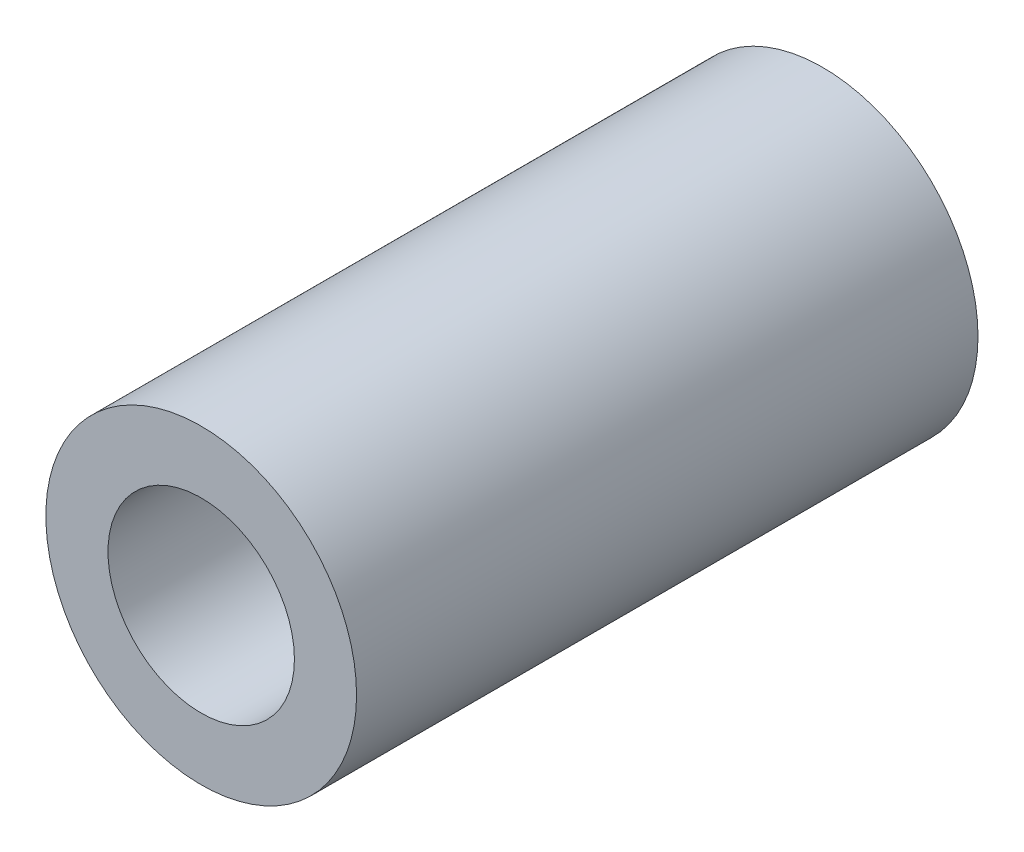
ISO-10303-21;
HEADER;
FILE_DESCRIPTION(('STEP AP214'),'2;1');
FILE_NAME('part.step','',(''),(''),'','','');
FILE_SCHEMA(('AUTOMOTIVE_DESIGN { 1 0 10303 214 1 1 1 1 }'));
ENDSEC;
DATA;
#1=APPLICATION_CONTEXT('core data for automotive mechanical design processes');
#2=APPLICATION_PROTOCOL_DEFINITION('international standard','automotive_design',2000,#1);
#3=PRODUCT_CONTEXT('',#1,'mechanical');
#4=PRODUCT('Part','Part','',(#3));
#5=PRODUCT_RELATED_PRODUCT_CATEGORY('part','',(#4));
#6=PRODUCT_DEFINITION_FORMATION('','',#4);
#7=PRODUCT_DEFINITION_CONTEXT('part definition',#1,'design');
#8=PRODUCT_DEFINITION('design','',#6,#7);
#9=PRODUCT_DEFINITION_SHAPE('','',#8);
#10=(LENGTH_UNIT() NAMED_UNIT(*) SI_UNIT(.MILLI.,.METRE.));
#11=(NAMED_UNIT(*) PLANE_ANGLE_UNIT() SI_UNIT($,.RADIAN.));
#12=(NAMED_UNIT(*) SI_UNIT($,.STERADIAN.) SOLID_ANGLE_UNIT());
#13=UNCERTAINTY_MEASURE_WITH_UNIT(LENGTH_MEASURE(1.E-05),#10,'distance_accuracy_value','');
#14=(GEOMETRIC_REPRESENTATION_CONTEXT(3) GLOBAL_UNCERTAINTY_ASSIGNED_CONTEXT((#13)) GLOBAL_UNIT_ASSIGNED_CONTEXT((#10,
#11,#12)) REPRESENTATION_CONTEXT('',''));
#15=CARTESIAN_POINT('',(0.,0.,0.));
#16=DIRECTION('',(0.,0.,1.));
#17=DIRECTION('',(1.,0.,0.));
#18=AXIS2_PLACEMENT_3D('',#15,#16,#17);
#19=CARTESIAN_POINT('',(0.,0.,20.));
#20=DIRECTION('',(0.,0.,1.));
#21=DIRECTION('',(1.,0.,0.));
#22=AXIS2_PLACEMENT_3D('',#19,#20,#21);
#23=PLANE('',#22);
#24=CARTESIAN_POINT('',(0.,0.,20.));
#25=DIRECTION('',(0.,0.,1.));
#26=DIRECTION('',(1.,0.,0.));
#27=AXIS2_PLACEMENT_3D('',#24,#25,#26);
#28=CIRCLE('',#27,5.);
#29=CARTESIAN_POINT('',(5.,0.,20.));
#30=VERTEX_POINT('',#29);
#31=EDGE_CURVE('E10',#30,#30,#28,.T.);
#32=ORIENTED_EDGE('',*,*,#31,.T.);
#33=EDGE_LOOP('',(#32));
#34=FACE_BOUND('',#33,.T.);
#35=CARTESIAN_POINT('',(0.,0.,20.));
#36=DIRECTION('',(0.,0.,1.));
#37=DIRECTION('',(1.,0.,0.));
#38=AXIS2_PLACEMENT_3D('',#35,#36,#37);
#39=CIRCLE('',#38,3.);
#40=CARTESIAN_POINT('',(3.,0.,20.));
#41=VERTEX_POINT('',#40);
#42=EDGE_CURVE('E50',#41,#41,#39,.T.);
#43=ORIENTED_EDGE('',*,*,#42,.F.);
#44=EDGE_LOOP('',(#43));
#45=FACE_BOUND('',#44,.T.);
#46=ADVANCED_FACE('F37',(#34,#45),#23,.T.);
#47=CARTESIAN_POINT('',(0.,0.,0.));
#48=DIRECTION('',(0.,0.,1.));
#49=DIRECTION('',(1.,0.,0.));
#50=AXIS2_PLACEMENT_3D('',#47,#48,#49);
#51=PLANE('',#50);
#52=CARTESIAN_POINT('',(0.,0.,0.));
#53=DIRECTION('',(0.,0.,1.));
#54=DIRECTION('',(1.,0.,0.));
#55=AXIS2_PLACEMENT_3D('',#52,#53,#54);
#56=CIRCLE('',#55,5.);
#57=CARTESIAN_POINT('',(5.,0.,0.));
#58=VERTEX_POINT('',#57);
#59=EDGE_CURVE('E41',#58,#58,#56,.T.);
#60=ORIENTED_EDGE('',*,*,#59,.F.);
#61=EDGE_LOOP('',(#60));
#62=FACE_BOUND('',#61,.T.);
#63=CARTESIAN_POINT('',(0.,0.,0.));
#64=DIRECTION('',(0.,0.,1.));
#65=DIRECTION('',(1.,0.,0.));
#66=AXIS2_PLACEMENT_3D('',#63,#64,#65);
#67=CIRCLE('',#66,3.);
#68=CARTESIAN_POINT('',(3.,0.,0.));
#69=VERTEX_POINT('',#68);
#70=EDGE_CURVE('E52',#69,#69,#67,.T.);
#71=ORIENTED_EDGE('',*,*,#70,.T.);
#72=EDGE_LOOP('',(#71));
#73=FACE_BOUND('',#72,.T.);
#74=ADVANCED_FACE('F64',(#62,#73),#51,.F.);
#75=CARTESIAN_POINT('',(0.,0.,20.));
#76=DIRECTION('',(0.,0.,-1.));
#77=DIRECTION('',(-1.,0.,0.));
#78=AXIS2_PLACEMENT_3D('',#75,#76,#77);
#79=CYLINDRICAL_SURFACE('',#78,5.);
#80=ORIENTED_EDGE('',*,*,#31,.F.);
#81=EDGE_LOOP('',(#80));
#82=FACE_BOUND('',#81,.T.);
#83=ORIENTED_EDGE('',*,*,#59,.T.);
#84=EDGE_LOOP('',(#83));
#85=FACE_BOUND('',#84,.T.);
#86=ADVANCED_FACE('F39',(#82,#85),#79,.T.);
#87=CARTESIAN_POINT('',(0.,0.,20.));
#88=DIRECTION('',(0.,0.,-1.));
#89=DIRECTION('',(-1.,0.,0.));
#90=AXIS2_PLACEMENT_3D('',#87,#88,#89);
#91=CYLINDRICAL_SURFACE('',#90,3.);
#92=ORIENTED_EDGE('',*,*,#42,.T.);
#93=EDGE_LOOP('',(#92));
#94=FACE_BOUND('',#93,.T.);
#95=ORIENTED_EDGE('',*,*,#70,.F.);
#96=EDGE_LOOP('',(#95));
#97=FACE_BOUND('',#96,.T.);
#98=ADVANCED_FACE('F60',(#94,#97),#91,.F.);
#99=CLOSED_SHELL('',(#46,#74,#86,#98));
#100=MANIFOLD_SOLID_BREP('B2',#99);
#101=ADVANCED_BREP_SHAPE_REPRESENTATION('',(#18,#100),#14);
#102=SHAPE_DEFINITION_REPRESENTATION(#9,#101);
ENDSEC;
END-ISO-10303-21;
